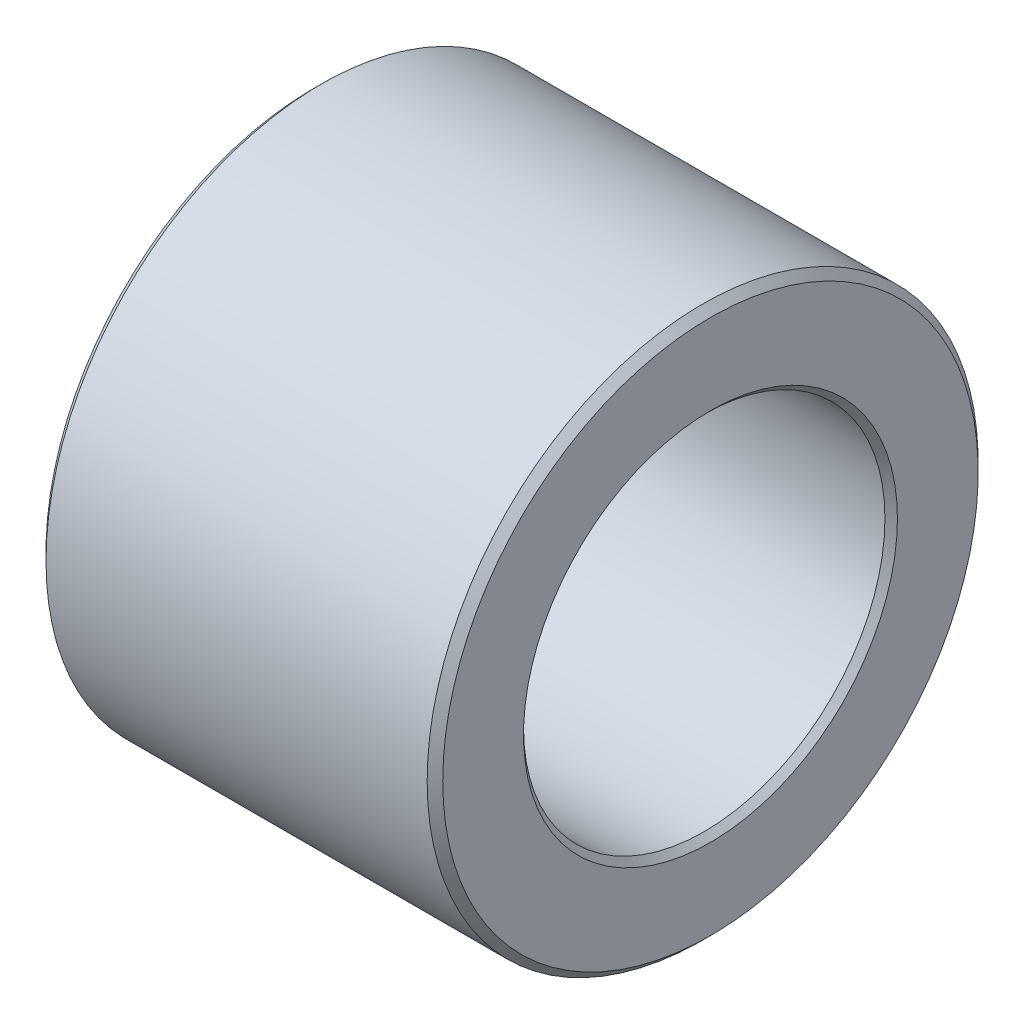
ISO-10303-21;
HEADER;
FILE_DESCRIPTION(('STEP AP214'),'2;1');
FILE_NAME('part.step','',(''),(''),'','','');
FILE_SCHEMA(('AUTOMOTIVE_DESIGN { 1 0 10303 214 1 1 1 1 }'));
ENDSEC;
DATA;
#1=APPLICATION_CONTEXT('core data for automotive mechanical design processes');
#2=APPLICATION_PROTOCOL_DEFINITION('international standard','automotive_design',2000,#1);
#3=PRODUCT_CONTEXT('',#1,'mechanical');
#4=PRODUCT('Part','Part','',(#3));
#5=PRODUCT_RELATED_PRODUCT_CATEGORY('part','',(#4));
#6=PRODUCT_DEFINITION_FORMATION('','',#4);
#7=PRODUCT_DEFINITION_CONTEXT('part definition',#1,'design');
#8=PRODUCT_DEFINITION('design','',#6,#7);
#9=PRODUCT_DEFINITION_SHAPE('','',#8);
#10=(LENGTH_UNIT() NAMED_UNIT(*) SI_UNIT(.MILLI.,.METRE.));
#11=(NAMED_UNIT(*) PLANE_ANGLE_UNIT() SI_UNIT($,.RADIAN.));
#12=(NAMED_UNIT(*) SI_UNIT($,.STERADIAN.) SOLID_ANGLE_UNIT());
#13=UNCERTAINTY_MEASURE_WITH_UNIT(LENGTH_MEASURE(1.E-05),#10,'distance_accuracy_value','');
#14=(GEOMETRIC_REPRESENTATION_CONTEXT(3) GLOBAL_UNCERTAINTY_ASSIGNED_CONTEXT((#13)) GLOBAL_UNIT_ASSIGNED_CONTEXT((#10,
#11,#12)) REPRESENTATION_CONTEXT('',''));
#15=CARTESIAN_POINT('',(0.,0.,0.));
#16=DIRECTION('',(0.,0.,1.));
#17=DIRECTION('',(1.,0.,0.));
#18=AXIS2_PLACEMENT_3D('',#15,#16,#17);
#19=CARTESIAN_POINT('',(50.,0.,0.));
#20=DIRECTION('',(-1.,0.,0.));
#21=DIRECTION('',(0.,0.,1.));
#22=AXIS2_PLACEMENT_3D('',#19,#20,#21);
#23=CYLINDRICAL_SURFACE('',#22,4.1);
#24=CARTESIAN_POINT('',(0.176776695354874,0.,0.));
#25=DIRECTION('',(-1.,0.,0.));
#26=DIRECTION('',(0.,0.,1.));
#27=AXIS2_PLACEMENT_3D('',#24,#25,#26);
#28=CIRCLE('',#27,4.099999999994);
#29=CARTESIAN_POINT('',(0.176776695354874,0.,4.099999999994));
#30=VERTEX_POINT('',#29);
#31=EDGE_CURVE('E38',#30,#30,#28,.T.);
#32=ORIENTED_EDGE('',*,*,#31,.T.);
#33=EDGE_LOOP('',(#32));
#34=FACE_BOUND('',#33,.T.);
#35=CARTESIAN_POINT('',(8.85857864381023,0.,0.));
#36=DIRECTION('',(1.,0.,0.));
#37=DIRECTION('',(0.,0.,-1.));
#38=AXIS2_PLACEMENT_3D('',#35,#36,#37);
#39=CIRCLE('',#38,4.099999999994);
#40=CARTESIAN_POINT('',(8.85857864381023,0.,-4.099999999994));
#41=VERTEX_POINT('',#40);
#42=EDGE_CURVE('E34',#41,#41,#39,.T.);
#43=ORIENTED_EDGE('',*,*,#42,.T.);
#44=EDGE_LOOP('',(#43));
#45=FACE_BOUND('',#44,.T.);
#46=ADVANCED_FACE('F15',(#34,#45),#23,.F.);
#47=CARTESIAN_POINT('',(1.13686837721616E-10,0.,0.));
#48=DIRECTION('',(-1.,0.,0.));
#49=DIRECTION('',(0.,0.,1.));
#50=AXIS2_PLACEMENT_3D('',#47,#48,#49);
#51=CONICAL_SURFACE('',#50,4.27677669523518,0.785398163397448);
#52=CARTESIAN_POINT('',(5.6843418860808E-11,0.,0.));
#53=DIRECTION('',(-1.,0.,0.));
#54=DIRECTION('',(0.,0.,1.));
#55=AXIS2_PLACEMENT_3D('',#52,#53,#54);
#56=CIRCLE('',#55,4.27677669529203);
#57=CARTESIAN_POINT('',(5.6843418860808E-11,0.,4.27677669529203));
#58=VERTEX_POINT('',#57);
#59=EDGE_CURVE('E37',#58,#58,#56,.F.);
#60=ORIENTED_EDGE('',*,*,#59,.F.);
#61=EDGE_LOOP('',(#60));
#62=FACE_BOUND('',#61,.T.);
#63=ORIENTED_EDGE('',*,*,#31,.F.);
#64=EDGE_LOOP('',(#63));
#65=FACE_BOUND('',#64,.T.);
#66=ADVANCED_FACE('F63',(#62,#65),#51,.F.);
#67=CARTESIAN_POINT('',(9.00000000001455,0.,0.));
#68=DIRECTION('',(1.,0.,0.));
#69=DIRECTION('',(0.,0.,-1.));
#70=AXIS2_PLACEMENT_3D('',#67,#68,#69);
#71=CONICAL_SURFACE('',#70,4.24142135619832,0.785398163397448);
#72=ORIENTED_EDGE('',*,*,#42,.F.);
#73=EDGE_LOOP('',(#72));
#74=FACE_BOUND('',#73,.T.);
#75=CARTESIAN_POINT('',(9.00000000001455,0.,0.));
#76=DIRECTION('',(1.,0.,0.));
#77=DIRECTION('',(0.,0.,-1.));
#78=AXIS2_PLACEMENT_3D('',#75,#76,#77);
#79=CIRCLE('',#78,4.24142135619832);
#80=CARTESIAN_POINT('',(9.00000000001455,0.,-4.24142135619832));
#81=VERTEX_POINT('',#80);
#82=EDGE_CURVE('E52',#81,#81,#79,.F.);
#83=ORIENTED_EDGE('',*,*,#82,.F.);
#84=EDGE_LOOP('',(#83));
#85=FACE_BOUND('',#84,.T.);
#86=ADVANCED_FACE('F66',(#74,#85),#71,.F.);
#87=CARTESIAN_POINT('',(0.,6.07322330470336,0.));
#88=DIRECTION('',(-1.,0.,0.));
#89=DIRECTION('',(0.,0.,1.));
#90=AXIS2_PLACEMENT_3D('',#87,#88,#89);
#91=PLANE('',#90);
#92=CARTESIAN_POINT('',(-5.6843418860808E-11,0.,0.));
#93=DIRECTION('',(1.,0.,0.));
#94=DIRECTION('',(0.,0.,-1.));
#95=AXIS2_PLACEMENT_3D('',#92,#93,#94);
#96=CIRCLE('',#95,6.07322330466786);
#97=CARTESIAN_POINT('',(-5.6843418860808E-11,0.,-6.07322330466786));
#98=VERTEX_POINT('',#97);
#99=EDGE_CURVE('E47',#98,#98,#96,.T.);
#100=ORIENTED_EDGE('',*,*,#99,.F.);
#101=EDGE_LOOP('',(#100));
#102=FACE_BOUND('',#101,.T.);
#103=ORIENTED_EDGE('',*,*,#59,.T.);
#104=EDGE_LOOP('',(#103));
#105=FACE_BOUND('',#104,.T.);
#106=ADVANCED_FACE('F61',(#102,#105),#91,.T.);
#107=CARTESIAN_POINT('',(9.,4.24142135623732,0.));
#108=DIRECTION('',(1.,0.,0.));
#109=DIRECTION('',(0.,0.,-1.));
#110=AXIS2_PLACEMENT_3D('',#107,#108,#109);
#111=PLANE('',#110);
#112=ORIENTED_EDGE('',*,*,#82,.T.);
#113=EDGE_LOOP('',(#112));
#114=FACE_BOUND('',#113,.T.);
#115=CARTESIAN_POINT('',(9.00000000001455,0.,0.));
#116=DIRECTION('',(-1.,0.,0.));
#117=DIRECTION('',(0.,0.,1.));
#118=AXIS2_PLACEMENT_3D('',#115,#116,#117);
#119=CIRCLE('',#118,6.07322330466786);
#120=CARTESIAN_POINT('',(9.00000000001455,0.,6.07322330466786));
#121=VERTEX_POINT('',#120);
#122=EDGE_CURVE('E27',#121,#121,#119,.T.);
#123=ORIENTED_EDGE('',*,*,#122,.F.);
#124=EDGE_LOOP('',(#123));
#125=FACE_BOUND('',#124,.T.);
#126=ADVANCED_FACE('F78',(#114,#125),#111,.T.);
#127=CARTESIAN_POINT('',(0.176776695298031,0.,0.));
#128=DIRECTION('',(1.,0.,0.));
#129=DIRECTION('',(0.,0.,-1.));
#130=AXIS2_PLACEMENT_3D('',#127,#128,#129);
#131=CONICAL_SURFACE('',#130,6.25000000002274,0.785398163397448);
#132=CARTESIAN_POINT('',(0.176776695296636,0.,0.));
#133=DIRECTION('',(-1.,0.,0.));
#134=DIRECTION('',(0.,0.,1.));
#135=AXIS2_PLACEMENT_3D('',#132,#133,#134);
#136=CIRCLE('',#135,6.25);
#137=CARTESIAN_POINT('',(0.176776695296636,0.,6.25));
#138=VERTEX_POINT('',#137);
#139=EDGE_CURVE('E22',#138,#138,#136,.F.);
#140=ORIENTED_EDGE('',*,*,#139,.F.);
#141=EDGE_LOOP('',(#140));
#142=FACE_BOUND('',#141,.T.);
#143=ORIENTED_EDGE('',*,*,#99,.T.);
#144=EDGE_LOOP('',(#143));
#145=FACE_BOUND('',#144,.T.);
#146=ADVANCED_FACE('F81',(#142,#145),#131,.T.);
#147=CARTESIAN_POINT('',(8.82322330460283,0.,0.));
#148=DIRECTION('',(-1.,0.,0.));
#149=DIRECTION('',(0.,0.,1.));
#150=AXIS2_PLACEMENT_3D('',#147,#148,#149);
#151=CONICAL_SURFACE('',#150,6.25000000007958,0.785398163397448);
#152=ORIENTED_EDGE('',*,*,#122,.T.);
#153=EDGE_LOOP('',(#152));
#154=FACE_BOUND('',#153,.T.);
#155=CARTESIAN_POINT('',(8.82322330470337,0.,0.));
#156=DIRECTION('',(-1.,0.,0.));
#157=DIRECTION('',(0.,0.,1.));
#158=AXIS2_PLACEMENT_3D('',#155,#156,#157);
#159=CIRCLE('',#158,6.25);
#160=CARTESIAN_POINT('',(8.82322330470337,0.,6.25));
#161=VERTEX_POINT('',#160);
#162=EDGE_CURVE('E10',#161,#161,#159,.T.);
#163=ORIENTED_EDGE('',*,*,#162,.F.);
#164=EDGE_LOOP('',(#163));
#165=FACE_BOUND('',#164,.T.);
#166=ADVANCED_FACE('F85',(#154,#165),#151,.T.);
#167=CARTESIAN_POINT('',(50.,0.,0.));
#168=DIRECTION('',(-1.,0.,0.));
#169=DIRECTION('',(0.,0.,1.));
#170=AXIS2_PLACEMENT_3D('',#167,#168,#169);
#171=CYLINDRICAL_SURFACE('',#170,6.25);
#172=ORIENTED_EDGE('',*,*,#162,.T.);
#173=EDGE_LOOP('',(#172));
#174=FACE_BOUND('',#173,.T.);
#175=ORIENTED_EDGE('',*,*,#139,.T.);
#176=EDGE_LOOP('',(#175));
#177=FACE_BOUND('',#176,.T.);
#178=ADVANCED_FACE('F88',(#174,#177),#171,.T.);
#179=CLOSED_SHELL('',(#46,#66,#86,#106,#126,#146,#166,#178));
#180=MANIFOLD_SOLID_BREP('B1',#179);
#181=ADVANCED_BREP_SHAPE_REPRESENTATION('',(#18,#180),#14);
#182=SHAPE_DEFINITION_REPRESENTATION(#9,#181);
ENDSEC;
END-ISO-10303-21;
